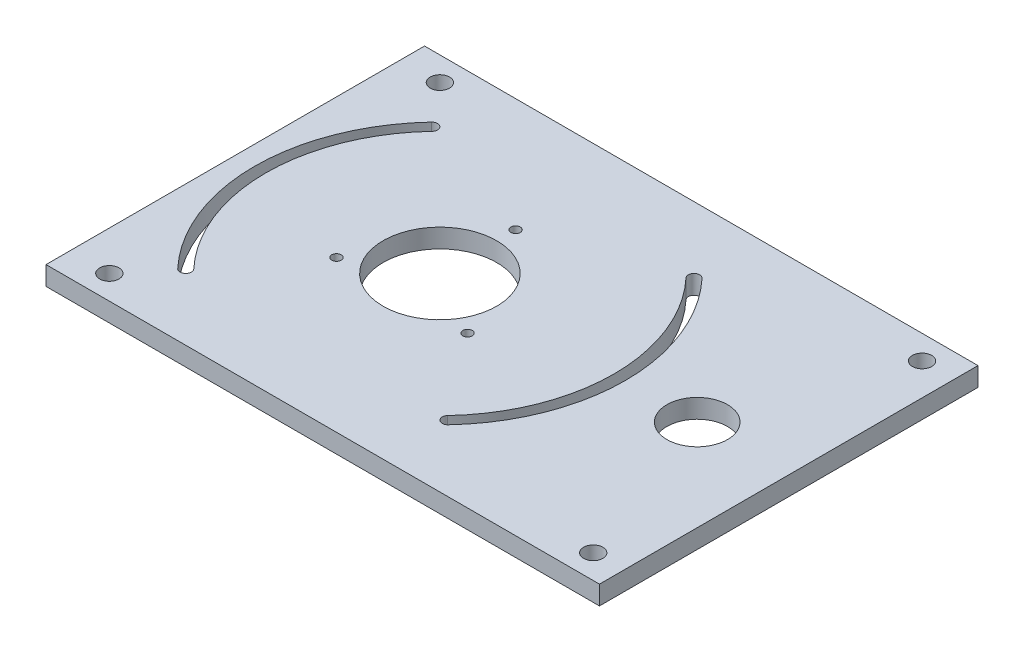
ISO-10303-21;
HEADER;
FILE_DESCRIPTION(('STEP AP214'),'2;1');
FILE_NAME('part.step','',(''),(''),'','','');
FILE_SCHEMA(('AUTOMOTIVE_DESIGN { 1 0 10303 214 1 1 1 1 }'));
ENDSEC;
DATA;
#1=APPLICATION_CONTEXT('core data for automotive mechanical design processes');
#2=APPLICATION_PROTOCOL_DEFINITION('international standard','automotive_design',2000,#1);
#3=PRODUCT_CONTEXT('',#1,'mechanical');
#4=PRODUCT('Part','Part','',(#3));
#5=PRODUCT_RELATED_PRODUCT_CATEGORY('part','',(#4));
#6=PRODUCT_DEFINITION_FORMATION('','',#4);
#7=PRODUCT_DEFINITION_CONTEXT('part definition',#1,'design');
#8=PRODUCT_DEFINITION('design','',#6,#7);
#9=PRODUCT_DEFINITION_SHAPE('','',#8);
#10=(LENGTH_UNIT() NAMED_UNIT(*) SI_UNIT(.MILLI.,.METRE.));
#11=(NAMED_UNIT(*) PLANE_ANGLE_UNIT() SI_UNIT($,.RADIAN.));
#12=(NAMED_UNIT(*) SI_UNIT($,.STERADIAN.) SOLID_ANGLE_UNIT());
#13=UNCERTAINTY_MEASURE_WITH_UNIT(LENGTH_MEASURE(1.E-05),#10,'distance_accuracy_value','');
#14=(GEOMETRIC_REPRESENTATION_CONTEXT(3) GLOBAL_UNCERTAINTY_ASSIGNED_CONTEXT((#13)) GLOBAL_UNIT_ASSIGNED_CONTEXT((#10,
#11,#12)) REPRESENTATION_CONTEXT('',''));
#15=CARTESIAN_POINT('',(0.,0.,0.));
#16=DIRECTION('',(0.,0.,1.));
#17=DIRECTION('',(1.,0.,0.));
#18=AXIS2_PLACEMENT_3D('',#15,#16,#17);
#19=CARTESIAN_POINT('',(-25.5137068979631,-11.,0.));
#20=DIRECTION('',(1.,0.,0.));
#21=DIRECTION('',(0.,0.,-1.));
#22=AXIS2_PLACEMENT_3D('',#19,#20,#21);
#23=PLANE('',#22);
#24=DIRECTION('',(0.,0.,-1.));
#25=VECTOR('',#24,1.);
#26=CARTESIAN_POINT('',(-25.5137068979631,0.,0.));
#27=LINE('',#26,#25);
#28=CARTESIAN_POINT('',(-25.5137068979631,0.,-10.8066674773634));
#29=VERTEX_POINT('',#28);
#30=CARTESIAN_POINT('',(-25.5137068979631,0.,-13.2994483486563));
#31=VERTEX_POINT('',#30);
#32=EDGE_CURVE('E113',#29,#31,#27,.T.);
#33=ORIENTED_EDGE('',*,*,#32,.F.);
#34=DIRECTION('',(0.,1.,0.));
#35=VECTOR('',#34,1.);
#36=CARTESIAN_POINT('',(-25.5137068979631,-11.,-10.8066674773634));
#37=LINE('',#36,#35);
#38=CARTESIAN_POINT('',(-25.5137068979631,-11.,-10.8066674773634));
#39=VERTEX_POINT('',#38);
#40=EDGE_CURVE('E12',#39,#29,#37,.T.);
#41=ORIENTED_EDGE('',*,*,#40,.F.);
#42=DIRECTION('',(0.,0.,-1.));
#43=VECTOR('',#42,1.);
#44=CARTESIAN_POINT('',(-25.5137068979631,-11.,0.));
#45=LINE('',#44,#43);
#46=CARTESIAN_POINT('',(-25.5137068979631,-11.,-13.2994483486563));
#47=VERTEX_POINT('',#46);
#48=EDGE_CURVE('E107',#39,#47,#45,.T.);
#49=ORIENTED_EDGE('',*,*,#48,.T.);
#50=DIRECTION('',(0.,1.,0.));
#51=VECTOR('',#50,1.);
#52=CARTESIAN_POINT('',(-25.5137068979631,-11.,-13.2994483486563));
#53=LINE('',#52,#51);
#54=EDGE_CURVE('E51',#47,#31,#53,.T.);
#55=ORIENTED_EDGE('',*,*,#54,.T.);
#56=EDGE_LOOP('',(#33,#41,#49,#55));
#57=FACE_BOUND('',#56,.T.);
#58=ADVANCED_FACE('F48',(#57),#23,.T.);
#59=CARTESIAN_POINT('',(0.,-11.,20.));
#60=DIRECTION('',(0.,1.,0.));
#61=DIRECTION('',(0.,0.,1.));
#62=AXIS2_PLACEMENT_3D('',#59,#60,#61);
#63=CYLINDRICAL_SURFACE('',#62,40.0000000092002);
#64=CARTESIAN_POINT('',(0.,0.,20.));
#65=DIRECTION('',(0.,1.,0.));
#66=DIRECTION('',(0.,0.,1.));
#67=AXIS2_PLACEMENT_3D('',#64,#65,#66);
#68=CIRCLE('',#67,40.0000000092002);
#69=CARTESIAN_POINT('',(-25.5137068979631,0.,50.8066674773635));
#70=VERTEX_POINT('',#69);
#71=EDGE_CURVE('E109',#29,#70,#68,.T.);
#72=ORIENTED_EDGE('',*,*,#71,.T.);
#73=DIRECTION('',(0.,1.,0.));
#74=VECTOR('',#73,1.);
#75=CARTESIAN_POINT('',(-25.5137068979631,-11.,50.8066674773635));
#76=LINE('',#75,#74);
#77=CARTESIAN_POINT('',(-25.5137068979631,-11.,50.8066674773635));
#78=VERTEX_POINT('',#77);
#79=EDGE_CURVE('E57',#78,#70,#76,.T.);
#80=ORIENTED_EDGE('',*,*,#79,.F.);
#81=CARTESIAN_POINT('',(0.,-11.,20.));
#82=DIRECTION('',(0.,1.,0.));
#83=DIRECTION('',(0.,0.,1.));
#84=AXIS2_PLACEMENT_3D('',#81,#82,#83);
#85=CIRCLE('',#84,40.0000000092002);
#86=EDGE_CURVE('E104',#39,#78,#85,.T.);
#87=ORIENTED_EDGE('',*,*,#86,.F.);
#88=ORIENTED_EDGE('',*,*,#40,.T.);
#89=EDGE_LOOP('',(#72,#80,#87,#88));
#90=FACE_BOUND('',#89,.T.);
#91=ADVANCED_FACE('F120',(#90),#63,.F.);
#92=CARTESIAN_POINT('',(-25.5137068979631,-11.,0.));
#93=DIRECTION('',(1.,0.,0.));
#94=DIRECTION('',(0.,0.,-1.));
#95=AXIS2_PLACEMENT_3D('',#92,#93,#94);
#96=PLANE('',#95);
#97=DIRECTION('',(0.,0.,-1.));
#98=VECTOR('',#97,1.);
#99=CARTESIAN_POINT('',(-25.5137068979631,0.,0.));
#100=LINE('',#99,#98);
#101=CARTESIAN_POINT('',(-25.5137068979631,0.,53.2994483486564));
#102=VERTEX_POINT('',#101);
#103=EDGE_CURVE('E98',#102,#70,#100,.T.);
#104=ORIENTED_EDGE('',*,*,#103,.F.);
#105=DIRECTION('',(0.,1.,0.));
#106=VECTOR('',#105,1.);
#107=CARTESIAN_POINT('',(-25.5137068979631,-11.,53.2994483486564));
#108=LINE('',#107,#106);
#109=CARTESIAN_POINT('',(-25.5137068979631,-11.,53.2994483486564));
#110=VERTEX_POINT('',#109);
#111=EDGE_CURVE('E93',#110,#102,#108,.T.);
#112=ORIENTED_EDGE('',*,*,#111,.F.);
#113=DIRECTION('',(0.,0.,-1.));
#114=VECTOR('',#113,1.);
#115=CARTESIAN_POINT('',(-25.5137068979631,-11.,0.));
#116=LINE('',#115,#114);
#117=EDGE_CURVE('E96',#110,#78,#116,.T.);
#118=ORIENTED_EDGE('',*,*,#117,.T.);
#119=ORIENTED_EDGE('',*,*,#79,.T.);
#120=EDGE_LOOP('',(#104,#112,#118,#119));
#121=FACE_BOUND('',#120,.T.);
#122=ADVANCED_FACE('F95',(#121),#96,.T.);
#123=CARTESIAN_POINT('',(0.,-11.,20.));
#124=DIRECTION('',(0.,1.,0.));
#125=DIRECTION('',(0.,0.,1.));
#126=AXIS2_PLACEMENT_3D('',#123,#124,#125);
#127=CYLINDRICAL_SURFACE('',#126,41.95);
#128=CARTESIAN_POINT('',(0.,0.,20.));
#129=DIRECTION('',(0.,1.,0.));
#130=DIRECTION('',(0.,0.,1.));
#131=AXIS2_PLACEMENT_3D('',#128,#129,#130);
#132=CIRCLE('',#131,41.95);
#133=EDGE_CURVE('E116',#31,#102,#132,.T.);
#134=ORIENTED_EDGE('',*,*,#133,.F.);
#135=ORIENTED_EDGE('',*,*,#54,.F.);
#136=CARTESIAN_POINT('',(0.,-11.,20.));
#137=DIRECTION('',(0.,1.,0.));
#138=DIRECTION('',(0.,0.,1.));
#139=AXIS2_PLACEMENT_3D('',#136,#137,#138);
#140=CIRCLE('',#139,41.95);
#141=EDGE_CURVE('E103',#47,#110,#140,.T.);
#142=ORIENTED_EDGE('',*,*,#141,.T.);
#143=ORIENTED_EDGE('',*,*,#111,.T.);
#144=EDGE_LOOP('',(#134,#135,#142,#143));
#145=FACE_BOUND('',#144,.T.);
#146=ADVANCED_FACE('F106',(#145),#127,.T.);
#147=CARTESIAN_POINT('',(0.,-11.,0.));
#148=DIRECTION('',(0.,1.,0.));
#149=DIRECTION('',(0.,0.,1.));
#150=AXIS2_PLACEMENT_3D('',#147,#148,#149);
#151=PLANE('',#150);
#152=ORIENTED_EDGE('',*,*,#48,.F.);
#153=ORIENTED_EDGE('',*,*,#86,.T.);
#154=ORIENTED_EDGE('',*,*,#117,.F.);
#155=ORIENTED_EDGE('',*,*,#141,.F.);
#156=EDGE_LOOP('',(#152,#153,#154,#155));
#157=FACE_BOUND('',#156,.T.);
#158=ADVANCED_FACE('F102',(#157),#151,.F.);
#159=CARTESIAN_POINT('',(0.,0.,0.));
#160=DIRECTION('',(0.,1.,0.));
#161=DIRECTION('',(0.,0.,1.));
#162=AXIS2_PLACEMENT_3D('',#159,#160,#161);
#163=PLANE('',#162);
#164=ORIENTED_EDGE('',*,*,#32,.T.);
#165=ORIENTED_EDGE('',*,*,#133,.T.);
#166=ORIENTED_EDGE('',*,*,#103,.T.);
#167=ORIENTED_EDGE('',*,*,#71,.F.);
#168=EDGE_LOOP('',(#164,#165,#166,#167));
#169=FACE_BOUND('',#168,.T.);
#170=ADVANCED_FACE('F122',(#169),#163,.T.);
#171=CLOSED_SHELL('',(#58,#91,#122,#146,#158,#170));
#172=MANIFOLD_SOLID_BREP('B2',#171);
#173=CARTESIAN_POINT('',(25.5137068979631,-11.,0.));
#174=DIRECTION('',(1.,0.,0.));
#175=DIRECTION('',(0.,0.,-1.));
#176=AXIS2_PLACEMENT_3D('',#173,#174,#175);
#177=PLANE('',#176);
#178=DIRECTION('',(0.,0.,-1.));
#179=VECTOR('',#178,1.);
#180=CARTESIAN_POINT('',(25.5137068979631,0.,0.));
#181=LINE('',#180,#179);
#182=CARTESIAN_POINT('',(25.5137068979631,0.,53.2994483486564));
#183=VERTEX_POINT('',#182);
#184=CARTESIAN_POINT('',(25.5137068979631,0.,50.8066674773635));
#185=VERTEX_POINT('',#184);
#186=EDGE_CURVE('E245',#183,#185,#181,.T.);
#187=ORIENTED_EDGE('',*,*,#186,.T.);
#188=DIRECTION('',(0.,1.,0.));
#189=VECTOR('',#188,1.);
#190=CARTESIAN_POINT('',(25.5137068979631,-11.,50.8066674773635));
#191=LINE('',#190,#189);
#192=CARTESIAN_POINT('',(25.5137068979631,-11.,50.8066674773635));
#193=VERTEX_POINT('',#192);
#194=EDGE_CURVE('E46',#193,#185,#191,.T.);
#195=ORIENTED_EDGE('',*,*,#194,.F.);
#196=DIRECTION('',(0.,0.,-1.));
#197=VECTOR('',#196,1.);
#198=CARTESIAN_POINT('',(25.5137068979631,-11.,0.));
#199=LINE('',#198,#197);
#200=CARTESIAN_POINT('',(25.5137068979631,-11.,53.2994483486564));
#201=VERTEX_POINT('',#200);
#202=EDGE_CURVE('E240',#201,#193,#199,.T.);
#203=ORIENTED_EDGE('',*,*,#202,.F.);
#204=DIRECTION('',(0.,1.,0.));
#205=VECTOR('',#204,1.);
#206=CARTESIAN_POINT('',(25.5137068979631,-11.,53.2994483486564));
#207=LINE('',#206,#205);
#208=EDGE_CURVE('E184',#201,#183,#207,.T.);
#209=ORIENTED_EDGE('',*,*,#208,.T.);
#210=EDGE_LOOP('',(#187,#195,#203,#209));
#211=FACE_BOUND('',#210,.T.);
#212=ADVANCED_FACE('F181',(#211),#177,.F.);
#213=CARTESIAN_POINT('',(0.,-11.,20.));
#214=DIRECTION('',(0.,1.,0.));
#215=DIRECTION('',(0.,0.,1.));
#216=AXIS2_PLACEMENT_3D('',#213,#214,#215);
#217=CYLINDRICAL_SURFACE('',#216,40.0000000092002);
#218=CARTESIAN_POINT('',(0.,0.,20.));
#219=DIRECTION('',(0.,1.,0.));
#220=DIRECTION('',(0.,0.,1.));
#221=AXIS2_PLACEMENT_3D('',#218,#219,#220);
#222=CIRCLE('',#221,40.0000000092002);
#223=CARTESIAN_POINT('',(25.5137068979631,0.,-10.8066674773634));
#224=VERTEX_POINT('',#223);
#225=EDGE_CURVE('E212',#185,#224,#222,.T.);
#226=ORIENTED_EDGE('',*,*,#225,.T.);
#227=DIRECTION('',(0.,1.,0.));
#228=VECTOR('',#227,1.);
#229=CARTESIAN_POINT('',(25.5137068979631,-11.,-10.8066674773634));
#230=LINE('',#229,#228);
#231=CARTESIAN_POINT('',(25.5137068979631,-11.,-10.8066674773634));
#232=VERTEX_POINT('',#231);
#233=EDGE_CURVE('E190',#232,#224,#230,.T.);
#234=ORIENTED_EDGE('',*,*,#233,.F.);
#235=CARTESIAN_POINT('',(0.,-11.,20.));
#236=DIRECTION('',(0.,1.,0.));
#237=DIRECTION('',(0.,0.,1.));
#238=AXIS2_PLACEMENT_3D('',#235,#236,#237);
#239=CIRCLE('',#238,40.0000000092002);
#240=EDGE_CURVE('E198',#193,#232,#239,.T.);
#241=ORIENTED_EDGE('',*,*,#240,.F.);
#242=ORIENTED_EDGE('',*,*,#194,.T.);
#243=EDGE_LOOP('',(#226,#234,#241,#242));
#244=FACE_BOUND('',#243,.T.);
#245=ADVANCED_FACE('F255',(#244),#217,.F.);
#246=CARTESIAN_POINT('',(25.5137068979631,-11.,0.));
#247=DIRECTION('',(1.,0.,0.));
#248=DIRECTION('',(0.,0.,-1.));
#249=AXIS2_PLACEMENT_3D('',#246,#247,#248);
#250=PLANE('',#249);
#251=DIRECTION('',(0.,0.,-1.));
#252=VECTOR('',#251,1.);
#253=CARTESIAN_POINT('',(25.5137068979631,0.,0.));
#254=LINE('',#253,#252);
#255=CARTESIAN_POINT('',(25.5137068979631,0.,-13.2994483486563));
#256=VERTEX_POINT('',#255);
#257=EDGE_CURVE('E237',#224,#256,#254,.T.);
#258=ORIENTED_EDGE('',*,*,#257,.T.);
#259=DIRECTION('',(0.,1.,0.));
#260=VECTOR('',#259,1.);
#261=CARTESIAN_POINT('',(25.5137068979631,-11.,-13.2994483486563));
#262=LINE('',#261,#260);
#263=CARTESIAN_POINT('',(25.5137068979631,-11.,-13.2994483486563));
#264=VERTEX_POINT('',#263);
#265=EDGE_CURVE('E235',#264,#256,#262,.T.);
#266=ORIENTED_EDGE('',*,*,#265,.F.);
#267=DIRECTION('',(0.,0.,-1.));
#268=VECTOR('',#267,1.);
#269=CARTESIAN_POINT('',(25.5137068979631,-11.,0.));
#270=LINE('',#269,#268);
#271=EDGE_CURVE('E228',#232,#264,#270,.T.);
#272=ORIENTED_EDGE('',*,*,#271,.F.);
#273=ORIENTED_EDGE('',*,*,#233,.T.);
#274=EDGE_LOOP('',(#258,#266,#272,#273));
#275=FACE_BOUND('',#274,.T.);
#276=ADVANCED_FACE('F236',(#275),#250,.F.);
#277=CARTESIAN_POINT('',(0.,-11.,20.));
#278=DIRECTION('',(0.,1.,0.));
#279=DIRECTION('',(0.,0.,1.));
#280=AXIS2_PLACEMENT_3D('',#277,#278,#279);
#281=CYLINDRICAL_SURFACE('',#280,41.95);
#282=CARTESIAN_POINT('',(0.,0.,20.));
#283=DIRECTION('',(0.,1.,0.));
#284=DIRECTION('',(0.,0.,1.));
#285=AXIS2_PLACEMENT_3D('',#282,#283,#284);
#286=CIRCLE('',#285,41.95);
#287=EDGE_CURVE('E248',#183,#256,#286,.T.);
#288=ORIENTED_EDGE('',*,*,#287,.F.);
#289=ORIENTED_EDGE('',*,*,#208,.F.);
#290=CARTESIAN_POINT('',(0.,-11.,20.));
#291=DIRECTION('',(0.,1.,0.));
#292=DIRECTION('',(0.,0.,1.));
#293=AXIS2_PLACEMENT_3D('',#290,#291,#292);
#294=CIRCLE('',#293,41.95);
#295=EDGE_CURVE('E231',#201,#264,#294,.T.);
#296=ORIENTED_EDGE('',*,*,#295,.T.);
#297=ORIENTED_EDGE('',*,*,#265,.T.);
#298=EDGE_LOOP('',(#288,#289,#296,#297));
#299=FACE_BOUND('',#298,.T.);
#300=ADVANCED_FACE('F239',(#299),#281,.T.);
#301=CARTESIAN_POINT('',(0.,-11.,0.));
#302=DIRECTION('',(0.,1.,0.));
#303=DIRECTION('',(0.,0.,1.));
#304=AXIS2_PLACEMENT_3D('',#301,#302,#303);
#305=PLANE('',#304);
#306=ORIENTED_EDGE('',*,*,#202,.T.);
#307=ORIENTED_EDGE('',*,*,#240,.T.);
#308=ORIENTED_EDGE('',*,*,#271,.T.);
#309=ORIENTED_EDGE('',*,*,#295,.F.);
#310=EDGE_LOOP('',(#306,#307,#308,#309));
#311=FACE_BOUND('',#310,.T.);
#312=ADVANCED_FACE('F230',(#311),#305,.F.);
#313=CARTESIAN_POINT('',(0.,0.,0.));
#314=DIRECTION('',(0.,1.,0.));
#315=DIRECTION('',(0.,0.,1.));
#316=AXIS2_PLACEMENT_3D('',#313,#314,#315);
#317=PLANE('',#316);
#318=ORIENTED_EDGE('',*,*,#186,.F.);
#319=ORIENTED_EDGE('',*,*,#287,.T.);
#320=ORIENTED_EDGE('',*,*,#257,.F.);
#321=ORIENTED_EDGE('',*,*,#225,.F.);
#322=EDGE_LOOP('',(#318,#319,#320,#321));
#323=FACE_BOUND('',#322,.T.);
#324=ADVANCED_FACE('F252',(#323),#317,.T.);
#325=CLOSED_SHELL('',(#212,#245,#276,#300,#312,#324));
#326=MANIFOLD_SOLID_BREP('B6',#325);
#327=CARTESIAN_POINT('',(-34.6314808349689,5.,52.5101604914092));
#328=DIRECTION('',(0.,-1.,0.));
#329=DIRECTION('',(0.,0.,-1.));
#330=AXIS2_PLACEMENT_3D('',#327,#328,#329);
#331=CYLINDRICAL_SURFACE('',#330,1.5);
#332=CARTESIAN_POINT('',(-34.6314808349689,0.,52.5101604914092));
#333=DIRECTION('',(0.,1.,0.));
#334=DIRECTION('',(0.,0.,1.));
#335=AXIS2_PLACEMENT_3D('',#332,#333,#334);
#336=CIRCLE('',#335,1.5);
#337=CARTESIAN_POINT('',(-35.7251065455468,0.,53.5367971385064));
#338=VERTEX_POINT('',#337);
#339=CARTESIAN_POINT('',(-33.5378551243909,0.,51.4835238443121));
#340=VERTEX_POINT('',#339);
#341=EDGE_CURVE('E479',#338,#340,#336,.T.);
#342=ORIENTED_EDGE('',*,*,#341,.F.);
#343=DIRECTION('',(0.,-1.,0.));
#344=VECTOR('',#343,1.);
#345=CARTESIAN_POINT('',(-35.7251065455468,5.,53.5367971385064));
#346=LINE('',#345,#344);
#347=CARTESIAN_POINT('',(-35.7251065455468,5.,53.5367971385064));
#348=VERTEX_POINT('',#347);
#349=EDGE_CURVE('E179',#348,#338,#346,.T.);
#350=ORIENTED_EDGE('',*,*,#349,.F.);
#351=CARTESIAN_POINT('',(-34.6314808349689,5.,52.5101604914092));
#352=DIRECTION('',(0.,1.,0.));
#353=DIRECTION('',(0.,0.,1.));
#354=AXIS2_PLACEMENT_3D('',#351,#352,#353);
#355=CIRCLE('',#354,1.5);
#356=CARTESIAN_POINT('',(-33.5378551243909,5.,51.4835238443121));
#357=VERTEX_POINT('',#356);
#358=EDGE_CURVE('E416',#348,#357,#355,.T.);
#359=ORIENTED_EDGE('',*,*,#358,.T.);
#360=DIRECTION('',(0.,-1.,0.));
#361=VECTOR('',#360,1.);
#362=CARTESIAN_POINT('',(-33.5378551243909,5.,51.4835238443121));
#363=LINE('',#362,#361);
#364=EDGE_CURVE('E324',#357,#340,#363,.T.);
#365=ORIENTED_EDGE('',*,*,#364,.T.);
#366=EDGE_LOOP('',(#342,#350,#359,#365));
#367=FACE_BOUND('',#366,.T.);
#368=ADVANCED_FACE('F305',(#367),#331,.F.);
#369=CARTESIAN_POINT('',(0.,5.,20.));
#370=DIRECTION('',(0.,-1.,0.));
#371=DIRECTION('',(0.,0.,-1.));
#372=AXIS2_PLACEMENT_3D('',#369,#370,#371);
#373=CYLINDRICAL_SURFACE('',#372,49.);
#374=CARTESIAN_POINT('',(0.,0.,20.));
#375=DIRECTION('',(0.,1.,0.));
#376=DIRECTION('',(0.,0.,1.));
#377=AXIS2_PLACEMENT_3D('',#374,#375,#376);
#378=CIRCLE('',#377,49.);
#379=CARTESIAN_POINT('',(-35.7251065455468,0.,-13.5367971385063));
#380=VERTEX_POINT('',#379);
#381=EDGE_CURVE('E421',#338,#380,#378,.F.);
#382=ORIENTED_EDGE('',*,*,#381,.T.);
#383=DIRECTION('',(0.,-1.,0.));
#384=VECTOR('',#383,1.);
#385=CARTESIAN_POINT('',(-35.7251065455468,5.,-13.5367971385063));
#386=LINE('',#385,#384);
#387=CARTESIAN_POINT('',(-35.7251065455468,5.,-13.5367971385063));
#388=VERTEX_POINT('',#387);
#389=EDGE_CURVE('E315',#388,#380,#386,.T.);
#390=ORIENTED_EDGE('',*,*,#389,.F.);
#391=CARTESIAN_POINT('',(0.,5.,20.));
#392=DIRECTION('',(0.,1.,0.));
#393=DIRECTION('',(0.,0.,1.));
#394=AXIS2_PLACEMENT_3D('',#391,#392,#393);
#395=CIRCLE('',#394,49.);
#396=EDGE_CURVE('E410',#348,#388,#395,.F.);
#397=ORIENTED_EDGE('',*,*,#396,.F.);
#398=ORIENTED_EDGE('',*,*,#349,.T.);
#399=EDGE_LOOP('',(#382,#390,#397,#398));
#400=FACE_BOUND('',#399,.T.);
#401=ADVANCED_FACE('F419',(#400),#373,.F.);
#402=CARTESIAN_POINT('',(-34.6314808349689,5.,-12.5101604914092));
#403=DIRECTION('',(0.,-1.,0.));
#404=DIRECTION('',(0.,0.,-1.));
#405=AXIS2_PLACEMENT_3D('',#402,#403,#404);
#406=CYLINDRICAL_SURFACE('',#405,1.5);
#407=CARTESIAN_POINT('',(-34.6314808349689,0.,-12.5101604914092));
#408=DIRECTION('',(0.,1.,0.));
#409=DIRECTION('',(0.,0.,1.));
#410=AXIS2_PLACEMENT_3D('',#407,#408,#409);
#411=CIRCLE('',#410,1.5);
#412=CARTESIAN_POINT('',(-33.5378551243909,0.,-11.483523844312));
#413=VERTEX_POINT('',#412);
#414=EDGE_CURVE('E482',#380,#413,#411,.F.);
#415=ORIENTED_EDGE('',*,*,#414,.T.);
#416=DIRECTION('',(0.,-1.,0.));
#417=VECTOR('',#416,1.);
#418=CARTESIAN_POINT('',(-33.5378551243909,5.,-11.483523844312));
#419=LINE('',#418,#417);
#420=CARTESIAN_POINT('',(-33.5378551243909,5.,-11.483523844312));
#421=VERTEX_POINT('',#420);
#422=EDGE_CURVE('E362',#421,#413,#419,.T.);
#423=ORIENTED_EDGE('',*,*,#422,.F.);
#424=CARTESIAN_POINT('',(-34.6314808349689,5.,-12.5101604914092));
#425=DIRECTION('',(0.,1.,0.));
#426=DIRECTION('',(0.,0.,1.));
#427=AXIS2_PLACEMENT_3D('',#424,#425,#426);
#428=CIRCLE('',#427,1.5);
#429=EDGE_CURVE('E402',#388,#421,#428,.F.);
#430=ORIENTED_EDGE('',*,*,#429,.F.);
#431=ORIENTED_EDGE('',*,*,#389,.T.);
#432=EDGE_LOOP('',(#415,#423,#430,#431));
#433=FACE_BOUND('',#432,.T.);
#434=ADVANCED_FACE('F404',(#433),#406,.F.);
#435=CARTESIAN_POINT('',(-9.5814019802184E-13,5.,70.0000000000007));
#436=DIRECTION('',(0.,0.,1.));
#437=DIRECTION('',(1.,0.,0.));
#438=AXIS2_PLACEMENT_3D('',#435,#436,#437);
#439=PLANE('',#438);
#440=DIRECTION('',(-1.,0.,0.));
#441=VECTOR('',#440,1.);
#442=CARTESIAN_POINT('',(-9.5814019802184E-13,0.,70.0000000000007));
#443=LINE('',#442,#441);
#444=CARTESIAN_POINT('',(92.155544892293,0.,70.));
#445=VERTEX_POINT('',#444);
#446=CARTESIAN_POINT('',(-54.055544892293,0.,70.));
#447=VERTEX_POINT('',#446);
#448=EDGE_CURVE('E467',#445,#447,#443,.T.);
#449=ORIENTED_EDGE('',*,*,#448,.F.);
#450=DIRECTION('',(0.,-1.,0.));
#451=VECTOR('',#450,1.);
#452=CARTESIAN_POINT('',(92.155544892293,5.,70.));
#453=LINE('',#452,#451);
#454=CARTESIAN_POINT('',(92.155544892293,5.,70.));
#455=VERTEX_POINT('',#454);
#456=EDGE_CURVE('E433',#455,#445,#453,.T.);
#457=ORIENTED_EDGE('',*,*,#456,.F.);
#458=DIRECTION('',(-1.,0.,0.));
#459=VECTOR('',#458,1.);
#460=CARTESIAN_POINT('',(-9.5814019802184E-13,5.,70.0000000000007));
#461=LINE('',#460,#459);
#462=CARTESIAN_POINT('',(-54.055544892293,5.,70.));
#463=VERTEX_POINT('',#462);
#464=EDGE_CURVE('E515',#455,#463,#461,.T.);
#465=ORIENTED_EDGE('',*,*,#464,.T.);
#466=DIRECTION('',(0.,-1.,0.));
#467=VECTOR('',#466,1.);
#468=CARTESIAN_POINT('',(-54.055544892293,5.,70.));
#469=LINE('',#468,#467);
#470=EDGE_CURVE('E426',#463,#447,#469,.T.);
#471=ORIENTED_EDGE('',*,*,#470,.T.);
#472=EDGE_LOOP('',(#449,#457,#465,#471));
#473=FACE_BOUND('',#472,.T.);
#474=ADVANCED_FACE('F580',(#473),#439,.T.);
#475=CARTESIAN_POINT('',(92.155544892293,5.,0.));
#476=DIRECTION('',(-1.,0.,0.));
#477=DIRECTION('',(0.,0.,1.));
#478=AXIS2_PLACEMENT_3D('',#475,#476,#477);
#479=PLANE('',#478);
#480=DIRECTION('',(0.,0.,-1.));
#481=VECTOR('',#480,1.);
#482=CARTESIAN_POINT('',(92.155544892293,0.,0.));
#483=LINE('',#482,#481);
#484=CARTESIAN_POINT('',(92.155544892293,0.,-30.));
#485=VERTEX_POINT('',#484);
#486=EDGE_CURVE('E470',#445,#485,#483,.T.);
#487=ORIENTED_EDGE('',*,*,#486,.T.);
#488=DIRECTION('',(0.,-1.,0.));
#489=VECTOR('',#488,1.);
#490=CARTESIAN_POINT('',(92.155544892293,5.,-30.));
#491=LINE('',#490,#489);
#492=CARTESIAN_POINT('',(92.155544892293,5.,-30.));
#493=VERTEX_POINT('',#492);
#494=EDGE_CURVE('E430',#493,#485,#491,.T.);
#495=ORIENTED_EDGE('',*,*,#494,.F.);
#496=DIRECTION('',(0.,0.,-1.));
#497=VECTOR('',#496,1.);
#498=CARTESIAN_POINT('',(92.155544892293,5.,0.));
#499=LINE('',#498,#497);
#500=EDGE_CURVE('E518',#455,#493,#499,.T.);
#501=ORIENTED_EDGE('',*,*,#500,.F.);
#502=ORIENTED_EDGE('',*,*,#456,.T.);
#503=EDGE_LOOP('',(#487,#495,#501,#502));
#504=FACE_BOUND('',#503,.T.);
#505=ADVANCED_FACE('F576',(#504),#479,.F.);
#506=CARTESIAN_POINT('',(0.,5.,-30.));
#507=DIRECTION('',(0.,0.,1.));
#508=DIRECTION('',(1.,0.,0.));
#509=AXIS2_PLACEMENT_3D('',#506,#507,#508);
#510=PLANE('',#509);
#511=DIRECTION('',(-1.,0.,0.));
#512=VECTOR('',#511,1.);
#513=CARTESIAN_POINT('',(0.,0.,-30.));
#514=LINE('',#513,#512);
#515=CARTESIAN_POINT('',(-54.055544892293,0.,-30.));
#516=VERTEX_POINT('',#515);
#517=EDGE_CURVE('E473',#485,#516,#514,.T.);
#518=ORIENTED_EDGE('',*,*,#517,.T.);
#519=DIRECTION('',(0.,-1.,0.));
#520=VECTOR('',#519,1.);
#521=CARTESIAN_POINT('',(-54.055544892293,5.,-30.));
#522=LINE('',#521,#520);
#523=CARTESIAN_POINT('',(-54.055544892293,5.,-30.));
#524=VERTEX_POINT('',#523);
#525=EDGE_CURVE('E428',#524,#516,#522,.T.);
#526=ORIENTED_EDGE('',*,*,#525,.F.);
#527=DIRECTION('',(-1.,0.,0.));
#528=VECTOR('',#527,1.);
#529=CARTESIAN_POINT('',(0.,5.,-30.));
#530=LINE('',#529,#528);
#531=EDGE_CURVE('E521',#493,#524,#530,.T.);
#532=ORIENTED_EDGE('',*,*,#531,.F.);
#533=ORIENTED_EDGE('',*,*,#494,.T.);
#534=EDGE_LOOP('',(#518,#526,#532,#533));
#535=FACE_BOUND('',#534,.T.);
#536=ADVANCED_FACE('F573',(#535),#510,.F.);
#537=CARTESIAN_POINT('',(0.,5.,20.));
#538=DIRECTION('',(0.,-1.,0.));
#539=DIRECTION('',(0.,0.,-1.));
#540=AXIS2_PLACEMENT_3D('',#537,#538,#539);
#541=CYLINDRICAL_SURFACE('',#540,46.);
#542=CARTESIAN_POINT('',(0.,0.,20.));
#543=DIRECTION('',(0.,1.,0.));
#544=DIRECTION('',(0.,0.,1.));
#545=AXIS2_PLACEMENT_3D('',#542,#543,#544);
#546=CIRCLE('',#545,46.);
#547=CARTESIAN_POINT('',(33.5378551243909,0.,-11.483523844312));
#548=VERTEX_POINT('',#547);
#549=CARTESIAN_POINT('',(33.5378551243909,0.,51.4835238443121));
#550=VERTEX_POINT('',#549);
#551=EDGE_CURVE('E451',#548,#550,#546,.F.);
#552=ORIENTED_EDGE('',*,*,#551,.F.);
#553=DIRECTION('',(0.,-1.,0.));
#554=VECTOR('',#553,1.);
#555=CARTESIAN_POINT('',(33.5378551243909,5.,-11.483523844312));
#556=LINE('',#555,#554);
#557=CARTESIAN_POINT('',(33.5378551243909,5.,-11.483523844312));
#558=VERTEX_POINT('',#557);
#559=EDGE_CURVE('E374',#558,#548,#556,.T.);
#560=ORIENTED_EDGE('',*,*,#559,.F.);
#561=CARTESIAN_POINT('',(0.,5.,20.));
#562=DIRECTION('',(0.,1.,0.));
#563=DIRECTION('',(0.,0.,1.));
#564=AXIS2_PLACEMENT_3D('',#561,#562,#563);
#565=CIRCLE('',#564,46.);
#566=CARTESIAN_POINT('',(33.5378551243909,5.,51.4835238443121));
#567=VERTEX_POINT('',#566);
#568=EDGE_CURVE('E501',#558,#567,#565,.F.);
#569=ORIENTED_EDGE('',*,*,#568,.T.);
#570=DIRECTION('',(0.,-1.,0.));
#571=VECTOR('',#570,1.);
#572=CARTESIAN_POINT('',(33.5378551243909,5.,51.4835238443121));
#573=LINE('',#572,#571);
#574=EDGE_CURVE('E435',#567,#550,#573,.T.);
#575=ORIENTED_EDGE('',*,*,#574,.T.);
#576=EDGE_LOOP('',(#552,#560,#569,#575));
#577=FACE_BOUND('',#576,.T.);
#578=ADVANCED_FACE('F307',(#577),#541,.T.);
#579=CARTESIAN_POINT('',(34.6314808349689,5.,-12.5101604914092));
#580=DIRECTION('',(0.,-1.,0.));
#581=DIRECTION('',(0.,0.,-1.));
#582=AXIS2_PLACEMENT_3D('',#579,#580,#581);
#583=CYLINDRICAL_SURFACE('',#582,1.5);
#584=CARTESIAN_POINT('',(34.6314808349689,0.,-12.5101604914092));
#585=DIRECTION('',(0.,1.,0.));
#586=DIRECTION('',(0.,0.,1.));
#587=AXIS2_PLACEMENT_3D('',#584,#585,#586);
#588=CIRCLE('',#587,1.5);
#589=CARTESIAN_POINT('',(35.7251065455468,0.,-13.5367971385063));
#590=VERTEX_POINT('',#589);
#591=EDGE_CURVE('E446',#590,#548,#588,.T.);
#592=ORIENTED_EDGE('',*,*,#591,.F.);
#593=DIRECTION('',(0.,-1.,0.));
#594=VECTOR('',#593,1.);
#595=CARTESIAN_POINT('',(35.7251065455468,5.,-13.5367971385063));
#596=LINE('',#595,#594);
#597=CARTESIAN_POINT('',(35.7251065455468,5.,-13.5367971385063));
#598=VERTEX_POINT('',#597);
#599=EDGE_CURVE('E440',#598,#590,#596,.T.);
#600=ORIENTED_EDGE('',*,*,#599,.F.);
#601=CARTESIAN_POINT('',(34.6314808349689,5.,-12.5101604914092));
#602=DIRECTION('',(0.,1.,0.));
#603=DIRECTION('',(0.,0.,1.));
#604=AXIS2_PLACEMENT_3D('',#601,#602,#603);
#605=CIRCLE('',#604,1.5);
#606=EDGE_CURVE('E449',#598,#558,#605,.T.);
#607=ORIENTED_EDGE('',*,*,#606,.T.);
#608=ORIENTED_EDGE('',*,*,#559,.T.);
#609=EDGE_LOOP('',(#592,#600,#607,#608));
#610=FACE_BOUND('',#609,.T.);
#611=ADVANCED_FACE('F444',(#610),#583,.F.);
#612=CARTESIAN_POINT('',(0.,5.,20.));
#613=DIRECTION('',(0.,-1.,0.));
#614=DIRECTION('',(0.,0.,-1.));
#615=AXIS2_PLACEMENT_3D('',#612,#613,#614);
#616=CYLINDRICAL_SURFACE('',#615,49.);
#617=CARTESIAN_POINT('',(0.,0.,20.));
#618=DIRECTION('',(0.,1.,0.));
#619=DIRECTION('',(0.,0.,1.));
#620=AXIS2_PLACEMENT_3D('',#617,#618,#619);
#621=CIRCLE('',#620,49.);
#622=CARTESIAN_POINT('',(35.7251065455468,0.,53.5367971385064));
#623=VERTEX_POINT('',#622);
#624=EDGE_CURVE('E460',#623,#590,#621,.T.);
#625=ORIENTED_EDGE('',*,*,#624,.F.);
#626=DIRECTION('',(0.,-1.,0.));
#627=VECTOR('',#626,1.);
#628=CARTESIAN_POINT('',(35.7251065455468,5.,53.5367971385064));
#629=LINE('',#628,#627);
#630=CARTESIAN_POINT('',(35.7251065455468,5.,53.5367971385064));
#631=VERTEX_POINT('',#630);
#632=EDGE_CURVE('E437',#631,#623,#629,.T.);
#633=ORIENTED_EDGE('',*,*,#632,.F.);
#634=CARTESIAN_POINT('',(0.,5.,20.));
#635=DIRECTION('',(0.,1.,0.));
#636=DIRECTION('',(0.,0.,1.));
#637=AXIS2_PLACEMENT_3D('',#634,#635,#636);
#638=CIRCLE('',#637,49.);
#639=EDGE_CURVE('E505',#631,#598,#638,.T.);
#640=ORIENTED_EDGE('',*,*,#639,.T.);
#641=ORIENTED_EDGE('',*,*,#599,.T.);
#642=EDGE_LOOP('',(#625,#633,#640,#641));
#643=FACE_BOUND('',#642,.T.);
#644=ADVANCED_FACE('F588',(#643),#616,.F.);
#645=CARTESIAN_POINT('',(-17.3127583340425,5.,30.0168995542529));
#646=DIRECTION('',(0.,-1.,0.));
#647=DIRECTION('',(0.,0.,-1.));
#648=AXIS2_PLACEMENT_3D('',#645,#646,#647);
#649=CYLINDRICAL_SURFACE('',#648,1.24999999999998);
#650=CARTESIAN_POINT('',(-17.3127583340425,5.,30.0168995542529));
#651=DIRECTION('',(0.,1.,0.));
#652=DIRECTION('',(0.,0.,1.));
#653=AXIS2_PLACEMENT_3D('',#650,#651,#652);
#654=CIRCLE('',#653,1.24999999999998);
#655=CARTESIAN_POINT('',(-17.3127583340425,5.,31.2668995542529));
#656=VERTEX_POINT('',#655);
#657=EDGE_CURVE('E537',#656,#656,#654,.T.);
#658=ORIENTED_EDGE('',*,*,#657,.T.);
#659=EDGE_LOOP('',(#658));
#660=FACE_BOUND('',#659,.T.);
#661=CARTESIAN_POINT('',(-17.3127583340425,0.,30.0168995542529));
#662=DIRECTION('',(0.,1.,0.));
#663=DIRECTION('',(0.,0.,1.));
#664=AXIS2_PLACEMENT_3D('',#661,#662,#663);
#665=CIRCLE('',#664,1.24999999999998);
#666=CARTESIAN_POINT('',(-17.3127583340425,0.,31.2668995542529));
#667=VERTEX_POINT('',#666);
#668=EDGE_CURVE('E496',#667,#667,#665,.T.);
#669=ORIENTED_EDGE('',*,*,#668,.F.);
#670=EDGE_LOOP('',(#669));
#671=FACE_BOUND('',#670,.T.);
#672=ADVANCED_FACE('F590',(#660,#671),#649,.F.);
#673=CARTESIAN_POINT('',(17.3192487362505,5.,30.0090972111395));
#674=DIRECTION('',(0.,-1.,0.));
#675=DIRECTION('',(0.,0.,-1.));
#676=AXIS2_PLACEMENT_3D('',#673,#674,#675);
#677=CYLINDRICAL_SURFACE('',#676,1.24999999999998);
#678=CARTESIAN_POINT('',(17.3192487362505,5.,30.0090972111395));
#679=DIRECTION('',(0.,1.,0.));
#680=DIRECTION('',(0.,0.,1.));
#681=AXIS2_PLACEMENT_3D('',#678,#679,#680);
#682=CIRCLE('',#681,1.24999999999998);
#683=CARTESIAN_POINT('',(17.3192487362505,5.,31.2590972111395));
#684=VERTEX_POINT('',#683);
#685=EDGE_CURVE('E534',#684,#684,#682,.T.);
#686=ORIENTED_EDGE('',*,*,#685,.T.);
#687=EDGE_LOOP('',(#686));
#688=FACE_BOUND('',#687,.T.);
#689=CARTESIAN_POINT('',(17.3192487362505,0.,30.0090972111395));
#690=DIRECTION('',(0.,1.,0.));
#691=DIRECTION('',(0.,0.,1.));
#692=AXIS2_PLACEMENT_3D('',#689,#690,#691);
#693=CIRCLE('',#692,1.24999999999998);
#694=CARTESIAN_POINT('',(17.3192487362505,0.,31.2590972111395));
#695=VERTEX_POINT('',#694);
#696=EDGE_CURVE('E493',#695,#695,#693,.T.);
#697=ORIENTED_EDGE('',*,*,#696,.F.);
#698=EDGE_LOOP('',(#697));
#699=FACE_BOUND('',#698,.T.);
#700=ADVANCED_FACE('F679',(#688,#699),#677,.F.);
#701=CARTESIAN_POINT('',(0.000990516123400287,5.,0.00520135897268126));
#702=DIRECTION('',(0.,-1.,0.));
#703=DIRECTION('',(0.,0.,-1.));
#704=AXIS2_PLACEMENT_3D('',#701,#702,#703);
#705=CYLINDRICAL_SURFACE('',#704,1.24999999999998);
#706=CARTESIAN_POINT('',(0.000990516123400287,5.,0.00520135897268126));
#707=DIRECTION('',(0.,1.,0.));
#708=DIRECTION('',(0.,0.,1.));
#709=AXIS2_PLACEMENT_3D('',#706,#707,#708);
#710=CIRCLE('',#709,1.24999999999998);
#711=CARTESIAN_POINT('',(0.000990516123400287,5.,1.25520135897266));
#712=VERTEX_POINT('',#711);
#713=EDGE_CURVE('E531',#712,#712,#710,.T.);
#714=ORIENTED_EDGE('',*,*,#713,.T.);
#715=EDGE_LOOP('',(#714));
#716=FACE_BOUND('',#715,.T.);
#717=CARTESIAN_POINT('',(0.000990516123400287,0.,0.00520135897268126));
#718=DIRECTION('',(0.,1.,0.));
#719=DIRECTION('',(0.,0.,1.));
#720=AXIS2_PLACEMENT_3D('',#717,#718,#719);
#721=CIRCLE('',#720,1.24999999999998);
#722=CARTESIAN_POINT('',(0.000990516123400287,0.,1.25520135897266));
#723=VERTEX_POINT('',#722);
#724=EDGE_CURVE('E490',#723,#723,#721,.T.);
#725=ORIENTED_EDGE('',*,*,#724,.F.);
#726=EDGE_LOOP('',(#725));
#727=FACE_BOUND('',#726,.T.);
#728=ADVANCED_FACE('F688',(#716,#727),#705,.F.);
#729=CARTESIAN_POINT('',(67.9999970572037,5.,20.0200055064452));
#730=DIRECTION('',(0.,-1.,0.));
#731=DIRECTION('',(0.,0.,-1.));
#732=AXIS2_PLACEMENT_3D('',#729,#730,#731);
#733=CYLINDRICAL_SURFACE('',#732,8.00000000000001);
#734=CARTESIAN_POINT('',(67.9999970572037,5.,20.0200055064452));
#735=DIRECTION('',(0.,1.,0.));
#736=DIRECTION('',(0.,0.,1.));
#737=AXIS2_PLACEMENT_3D('',#734,#735,#736);
#738=CIRCLE('',#737,8.00000000000001);
#739=CARTESIAN_POINT('',(67.9999970572037,5.,28.0200055064453));
#740=VERTEX_POINT('',#739);
#741=EDGE_CURVE('E528',#740,#740,#738,.T.);
#742=ORIENTED_EDGE('',*,*,#741,.T.);
#743=EDGE_LOOP('',(#742));
#744=FACE_BOUND('',#743,.T.);
#745=CARTESIAN_POINT('',(67.9999970572037,0.,20.0200055064452));
#746=DIRECTION('',(0.,1.,0.));
#747=DIRECTION('',(0.,0.,1.));
#748=AXIS2_PLACEMENT_3D('',#745,#746,#747);
#749=CIRCLE('',#748,8.00000000000001);
#750=CARTESIAN_POINT('',(67.9999970572037,0.,28.0200055064453));
#751=VERTEX_POINT('',#750);
#752=EDGE_CURVE('E487',#751,#751,#749,.T.);
#753=ORIENTED_EDGE('',*,*,#752,.F.);
#754=EDGE_LOOP('',(#753));
#755=FACE_BOUND('',#754,.T.);
#756=ADVANCED_FACE('F697',(#744,#755),#733,.F.);
#757=CARTESIAN_POINT('',(0.,5.,20.));
#758=DIRECTION('',(0.,-1.,0.));
#759=DIRECTION('',(0.,0.,-1.));
#760=AXIS2_PLACEMENT_3D('',#757,#758,#759);
#761=CYLINDRICAL_SURFACE('',#760,46.);
#762=CARTESIAN_POINT('',(0.,0.,20.));
#763=DIRECTION('',(0.,1.,0.));
#764=DIRECTION('',(0.,0.,1.));
#765=AXIS2_PLACEMENT_3D('',#762,#763,#764);
#766=CIRCLE('',#765,46.);
#767=EDGE_CURVE('E484',#340,#413,#766,.F.);
#768=ORIENTED_EDGE('',*,*,#767,.F.);
#769=ORIENTED_EDGE('',*,*,#364,.F.);
#770=CARTESIAN_POINT('',(0.,5.,20.));
#771=DIRECTION('',(0.,1.,0.));
#772=DIRECTION('',(0.,0.,1.));
#773=AXIS2_PLACEMENT_3D('',#770,#771,#772);
#774=CIRCLE('',#773,46.);
#775=EDGE_CURVE('E409',#357,#421,#774,.F.);
#776=ORIENTED_EDGE('',*,*,#775,.T.);
#777=ORIENTED_EDGE('',*,*,#422,.T.);
#778=EDGE_LOOP('',(#768,#769,#776,#777));
#779=FACE_BOUND('',#778,.T.);
#780=ADVANCED_FACE('F571',(#779),#761,.T.);
#781=CARTESIAN_POINT('',(-54.055544892293,5.,0.));
#782=DIRECTION('',(-1.,0.,0.));
#783=DIRECTION('',(0.,0.,1.));
#784=AXIS2_PLACEMENT_3D('',#781,#782,#783);
#785=PLANE('',#784);
#786=DIRECTION('',(0.,0.,-1.));
#787=VECTOR('',#786,1.);
#788=CARTESIAN_POINT('',(-54.055544892293,0.,0.));
#789=LINE('',#788,#787);
#790=EDGE_CURVE('E476',#447,#516,#789,.T.);
#791=ORIENTED_EDGE('',*,*,#790,.F.);
#792=ORIENTED_EDGE('',*,*,#470,.F.);
#793=DIRECTION('',(0.,0.,-1.));
#794=VECTOR('',#793,1.);
#795=CARTESIAN_POINT('',(-54.055544892293,5.,0.));
#796=LINE('',#795,#794);
#797=EDGE_CURVE('E523',#463,#524,#796,.T.);
#798=ORIENTED_EDGE('',*,*,#797,.T.);
#799=ORIENTED_EDGE('',*,*,#525,.T.);
#800=EDGE_LOOP('',(#791,#792,#798,#799));
#801=FACE_BOUND('',#800,.T.);
#802=ADVANCED_FACE('F568',(#801),#785,.T.);
#803=CARTESIAN_POINT('',(34.6314808349689,5.,52.5101604914092));
#804=DIRECTION('',(0.,-1.,0.));
#805=DIRECTION('',(0.,0.,-1.));
#806=AXIS2_PLACEMENT_3D('',#803,#804,#805);
#807=CYLINDRICAL_SURFACE('',#806,1.5);
#808=CARTESIAN_POINT('',(34.6314808349689,0.,52.5101604914092));
#809=DIRECTION('',(0.,1.,0.));
#810=DIRECTION('',(0.,0.,1.));
#811=AXIS2_PLACEMENT_3D('',#808,#809,#810);
#812=CIRCLE('',#811,1.5);
#813=EDGE_CURVE('E462',#623,#550,#812,.F.);
#814=ORIENTED_EDGE('',*,*,#813,.T.);
#815=ORIENTED_EDGE('',*,*,#574,.F.);
#816=CARTESIAN_POINT('',(34.6314808349689,5.,52.5101604914092));
#817=DIRECTION('',(0.,1.,0.));
#818=DIRECTION('',(0.,0.,1.));
#819=AXIS2_PLACEMENT_3D('',#816,#817,#818);
#820=CIRCLE('',#819,1.5);
#821=EDGE_CURVE('E513',#631,#567,#820,.F.);
#822=ORIENTED_EDGE('',*,*,#821,.F.);
#823=ORIENTED_EDGE('',*,*,#632,.T.);
#824=EDGE_LOOP('',(#814,#815,#822,#823));
#825=FACE_BOUND('',#824,.T.);
#826=ADVANCED_FACE('F555',(#825),#807,.F.);
#827=CARTESIAN_POINT('',(0.,5.,20.));
#828=DIRECTION('',(0.,-1.,0.));
#829=DIRECTION('',(0.,0.,-1.));
#830=AXIS2_PLACEMENT_3D('',#827,#828,#829);
#831=CYLINDRICAL_SURFACE('',#830,15.);
#832=CARTESIAN_POINT('',(0.,5.,20.));
#833=DIRECTION('',(0.,1.,0.));
#834=DIRECTION('',(0.,0.,1.));
#835=AXIS2_PLACEMENT_3D('',#832,#833,#834);
#836=CIRCLE('',#835,15.);
#837=CARTESIAN_POINT('',(0.,5.,35.0000000000001));
#838=VERTEX_POINT('',#837);
#839=EDGE_CURVE('E438',#838,#838,#836,.T.);
#840=ORIENTED_EDGE('',*,*,#839,.T.);
#841=EDGE_LOOP('',(#840));
#842=FACE_BOUND('',#841,.T.);
#843=CARTESIAN_POINT('',(0.,0.,20.));
#844=DIRECTION('',(0.,1.,0.));
#845=DIRECTION('',(0.,0.,1.));
#846=AXIS2_PLACEMENT_3D('',#843,#844,#845);
#847=CIRCLE('',#846,15.);
#848=CARTESIAN_POINT('',(0.,0.,35.0000000000001));
#849=VERTEX_POINT('',#848);
#850=EDGE_CURVE('E499',#849,#849,#847,.T.);
#851=ORIENTED_EDGE('',*,*,#850,.F.);
#852=EDGE_LOOP('',(#851));
#853=FACE_BOUND('',#852,.T.);
#854=ADVANCED_FACE('F542',(#842,#853),#831,.F.);
#855=CARTESIAN_POINT('',(0.,5.,0.));
#856=DIRECTION('',(0.,1.,0.));
#857=DIRECTION('',(0.,0.,1.));
#858=AXIS2_PLACEMENT_3D('',#855,#856,#857);
#859=PLANE('',#858);
#860=CARTESIAN_POINT('',(-43.6629042578193,5.,63.6629042578203));
#861=DIRECTION('',(0.,1.,0.));
#862=DIRECTION('',(0.,0.,1.));
#863=AXIS2_PLACEMENT_3D('',#860,#861,#862);
#864=CIRCLE('',#863,2.55269999999999);
#865=CARTESIAN_POINT('',(-43.6629042578193,5.,66.2156042578203));
#866=VERTEX_POINT('',#865);
#867=EDGE_CURVE('E879',#866,#866,#864,.T.);
#868=ORIENTED_EDGE('',*,*,#867,.F.);
#869=EDGE_LOOP('',(#868));
#870=FACE_BOUND('',#869,.T.);
#871=CARTESIAN_POINT('',(-43.6629042578201,5.,-23.6629042578194));
#872=DIRECTION('',(0.,1.,0.));
#873=DIRECTION('',(0.,0.,1.));
#874=AXIS2_PLACEMENT_3D('',#871,#872,#873);
#875=CIRCLE('',#874,2.55269999999999);
#876=CARTESIAN_POINT('',(-43.6629042578201,5.,-21.1102042578194));
#877=VERTEX_POINT('',#876);
#878=EDGE_CURVE('E889',#877,#877,#875,.T.);
#879=ORIENTED_EDGE('',*,*,#878,.F.);
#880=EDGE_LOOP('',(#879));
#881=FACE_BOUND('',#880,.T.);
#882=CARTESIAN_POINT('',(83.7109397886486,5.,-23.6629042578194));
#883=DIRECTION('',(0.,1.,0.));
#884=DIRECTION('',(0.,0.,1.));
#885=AXIS2_PLACEMENT_3D('',#882,#883,#884);
#886=CIRCLE('',#885,2.55269999999999);
#887=CARTESIAN_POINT('',(83.7109397886486,5.,-21.1102042578194));
#888=VERTEX_POINT('',#887);
#889=EDGE_CURVE('E894',#888,#888,#886,.T.);
#890=ORIENTED_EDGE('',*,*,#889,.F.);
#891=EDGE_LOOP('',(#890));
#892=FACE_BOUND('',#891,.T.);
#893=CARTESIAN_POINT('',(84.1709362179266,5.,63.6629042578203));
#894=DIRECTION('',(0.,1.,0.));
#895=DIRECTION('',(0.,0.,1.));
#896=AXIS2_PLACEMENT_3D('',#893,#894,#895);
#897=CIRCLE('',#896,2.55269999999999);
#898=CARTESIAN_POINT('',(84.1709362179266,5.,66.2156042578203));
#899=VERTEX_POINT('',#898);
#900=EDGE_CURVE('E309',#899,#899,#897,.T.);
#901=ORIENTED_EDGE('',*,*,#900,.F.);
#902=EDGE_LOOP('',(#901));
#903=FACE_BOUND('',#902,.T.);
#904=ORIENTED_EDGE('',*,*,#568,.F.);
#905=ORIENTED_EDGE('',*,*,#606,.F.);
#906=ORIENTED_EDGE('',*,*,#639,.F.);
#907=ORIENTED_EDGE('',*,*,#821,.T.);
#908=EDGE_LOOP('',(#904,#905,#906,#907));
#909=FACE_BOUND('',#908,.T.);
#910=ORIENTED_EDGE('',*,*,#464,.F.);
#911=ORIENTED_EDGE('',*,*,#500,.T.);
#912=ORIENTED_EDGE('',*,*,#531,.T.);
#913=ORIENTED_EDGE('',*,*,#797,.F.);
#914=EDGE_LOOP('',(#910,#911,#912,#913));
#915=FACE_BOUND('',#914,.T.);
#916=ORIENTED_EDGE('',*,*,#358,.F.);
#917=ORIENTED_EDGE('',*,*,#396,.T.);
#918=ORIENTED_EDGE('',*,*,#429,.T.);
#919=ORIENTED_EDGE('',*,*,#775,.F.);
#920=EDGE_LOOP('',(#916,#917,#918,#919));
#921=FACE_BOUND('',#920,.T.);
#922=ORIENTED_EDGE('',*,*,#741,.F.);
#923=EDGE_LOOP('',(#922));
#924=FACE_BOUND('',#923,.T.);
#925=ORIENTED_EDGE('',*,*,#713,.F.);
#926=EDGE_LOOP('',(#925));
#927=FACE_BOUND('',#926,.T.);
#928=ORIENTED_EDGE('',*,*,#685,.F.);
#929=EDGE_LOOP('',(#928));
#930=FACE_BOUND('',#929,.T.);
#931=ORIENTED_EDGE('',*,*,#657,.F.);
#932=EDGE_LOOP('',(#931));
#933=FACE_BOUND('',#932,.T.);
#934=ORIENTED_EDGE('',*,*,#839,.F.);
#935=EDGE_LOOP('',(#934));
#936=FACE_BOUND('',#935,.T.);
#937=ADVANCED_FACE('F414',(#870,#881,#892,#903,#909,#915,#921,#924,#927,#930,#933,#936),#859,.T.);
#938=CARTESIAN_POINT('',(0.,0.,0.));
#939=DIRECTION('',(0.,1.,0.));
#940=DIRECTION('',(0.,0.,1.));
#941=AXIS2_PLACEMENT_3D('',#938,#939,#940);
#942=PLANE('',#941);
#943=CARTESIAN_POINT('',(-43.6629042578193,0.,63.6629042578203));
#944=DIRECTION('',(0.,-1.,0.));
#945=DIRECTION('',(0.,0.,-1.));
#946=AXIS2_PLACEMENT_3D('',#943,#944,#945);
#947=CIRCLE('',#946,2.55269999999999);
#948=CARTESIAN_POINT('',(-43.6629042578193,0.,61.1102042578203));
#949=VERTEX_POINT('',#948);
#950=EDGE_CURVE('E882',#949,#949,#947,.T.);
#951=ORIENTED_EDGE('',*,*,#950,.F.);
#952=EDGE_LOOP('',(#951));
#953=FACE_BOUND('',#952,.T.);
#954=CARTESIAN_POINT('',(-43.6629042578201,0.,-23.6629042578194));
#955=DIRECTION('',(0.,-1.,0.));
#956=DIRECTION('',(0.,0.,-1.));
#957=AXIS2_PLACEMENT_3D('',#954,#955,#956);
#958=CIRCLE('',#957,2.55269999999999);
#959=CARTESIAN_POINT('',(-43.6629042578201,0.,-26.2156042578194));
#960=VERTEX_POINT('',#959);
#961=EDGE_CURVE('E884',#960,#960,#958,.T.);
#962=ORIENTED_EDGE('',*,*,#961,.F.);
#963=EDGE_LOOP('',(#962));
#964=FACE_BOUND('',#963,.T.);
#965=CARTESIAN_POINT('',(83.7109397886486,0.,-23.6629042578194));
#966=DIRECTION('',(0.,-1.,0.));
#967=DIRECTION('',(0.,0.,-1.));
#968=AXIS2_PLACEMENT_3D('',#965,#966,#967);
#969=CIRCLE('',#968,2.55269999999999);
#970=CARTESIAN_POINT('',(83.7109397886486,0.,-26.2156042578194));
#971=VERTEX_POINT('',#970);
#972=EDGE_CURVE('E892',#971,#971,#969,.T.);
#973=ORIENTED_EDGE('',*,*,#972,.F.);
#974=EDGE_LOOP('',(#973));
#975=FACE_BOUND('',#974,.T.);
#976=CARTESIAN_POINT('',(84.1709362179266,0.,63.6629042578203));
#977=DIRECTION('',(0.,-1.,0.));
#978=DIRECTION('',(0.,0.,-1.));
#979=AXIS2_PLACEMENT_3D('',#976,#977,#978);
#980=CIRCLE('',#979,2.55269999999999);
#981=CARTESIAN_POINT('',(84.1709362179266,0.,61.1102042578203));
#982=VERTEX_POINT('',#981);
#983=EDGE_CURVE('E508',#982,#982,#980,.T.);
#984=ORIENTED_EDGE('',*,*,#983,.F.);
#985=EDGE_LOOP('',(#984));
#986=FACE_BOUND('',#985,.T.);
#987=ORIENTED_EDGE('',*,*,#551,.T.);
#988=ORIENTED_EDGE('',*,*,#813,.F.);
#989=ORIENTED_EDGE('',*,*,#624,.T.);
#990=ORIENTED_EDGE('',*,*,#591,.T.);
#991=EDGE_LOOP('',(#987,#988,#989,#990));
#992=FACE_BOUND('',#991,.T.);
#993=ORIENTED_EDGE('',*,*,#448,.T.);
#994=ORIENTED_EDGE('',*,*,#790,.T.);
#995=ORIENTED_EDGE('',*,*,#517,.F.);
#996=ORIENTED_EDGE('',*,*,#486,.F.);
#997=EDGE_LOOP('',(#993,#994,#995,#996));
#998=FACE_BOUND('',#997,.T.);
#999=ORIENTED_EDGE('',*,*,#341,.T.);
#1000=ORIENTED_EDGE('',*,*,#767,.T.);
#1001=ORIENTED_EDGE('',*,*,#414,.F.);
#1002=ORIENTED_EDGE('',*,*,#381,.F.);
#1003=EDGE_LOOP('',(#999,#1000,#1001,#1002));
#1004=FACE_BOUND('',#1003,.T.);
#1005=ORIENTED_EDGE('',*,*,#752,.T.);
#1006=EDGE_LOOP('',(#1005));
#1007=FACE_BOUND('',#1006,.T.);
#1008=ORIENTED_EDGE('',*,*,#724,.T.);
#1009=EDGE_LOOP('',(#1008));
#1010=FACE_BOUND('',#1009,.T.);
#1011=ORIENTED_EDGE('',*,*,#696,.T.);
#1012=EDGE_LOOP('',(#1011));
#1013=FACE_BOUND('',#1012,.T.);
#1014=ORIENTED_EDGE('',*,*,#668,.T.);
#1015=EDGE_LOOP('',(#1014));
#1016=FACE_BOUND('',#1015,.T.);
#1017=ORIENTED_EDGE('',*,*,#850,.T.);
#1018=EDGE_LOOP('',(#1017));
#1019=FACE_BOUND('',#1018,.T.);
#1020=ADVANCED_FACE('F457',(#953,#964,#975,#986,#992,#998,#1004,#1007,#1010,#1013,#1016,#1019),
#942,.F.);
#1021=CARTESIAN_POINT('',(84.1709362179266,0.,63.6629042578203));
#1022=DIRECTION('',(0.,-1.,0.));
#1023=DIRECTION('',(0.,0.,-1.));
#1024=AXIS2_PLACEMENT_3D('',#1021,#1022,#1023);
#1025=CYLINDRICAL_SURFACE('',#1024,2.55269999999999);
#1026=ORIENTED_EDGE('',*,*,#900,.T.);
#1027=EDGE_LOOP('',(#1026));
#1028=FACE_BOUND('',#1027,.T.);
#1029=ORIENTED_EDGE('',*,*,#983,.T.);
#1030=EDGE_LOOP('',(#1029));
#1031=FACE_BOUND('',#1030,.T.);
#1032=ADVANCED_FACE('F552',(#1028,#1031),#1025,.F.);
#1033=CARTESIAN_POINT('',(83.7109397886486,0.,-23.6629042578194));
#1034=DIRECTION('',(0.,-1.,0.));
#1035=DIRECTION('',(0.,0.,-1.));
#1036=AXIS2_PLACEMENT_3D('',#1033,#1034,#1035);
#1037=CYLINDRICAL_SURFACE('',#1036,2.55269999999999);
#1038=ORIENTED_EDGE('',*,*,#889,.T.);
#1039=EDGE_LOOP('',(#1038));
#1040=FACE_BOUND('',#1039,.T.);
#1041=ORIENTED_EDGE('',*,*,#972,.T.);
#1042=EDGE_LOOP('',(#1041));
#1043=FACE_BOUND('',#1042,.T.);
#1044=ADVANCED_FACE('F844',(#1040,#1043),#1037,.F.);
#1045=CARTESIAN_POINT('',(-43.6629042578201,0.,-23.6629042578194));
#1046=DIRECTION('',(0.,-1.,0.));
#1047=DIRECTION('',(0.,0.,-1.));
#1048=AXIS2_PLACEMENT_3D('',#1045,#1046,#1047);
#1049=CYLINDRICAL_SURFACE('',#1048,2.55269999999999);
#1050=ORIENTED_EDGE('',*,*,#878,.T.);
#1051=EDGE_LOOP('',(#1050));
#1052=FACE_BOUND('',#1051,.T.);
#1053=ORIENTED_EDGE('',*,*,#961,.T.);
#1054=EDGE_LOOP('',(#1053));
#1055=FACE_BOUND('',#1054,.T.);
#1056=ADVANCED_FACE('F852',(#1052,#1055),#1049,.F.);
#1057=CARTESIAN_POINT('',(-43.6629042578193,0.,63.6629042578203));
#1058=DIRECTION('',(0.,-1.,0.));
#1059=DIRECTION('',(0.,0.,-1.));
#1060=AXIS2_PLACEMENT_3D('',#1057,#1058,#1059);
#1061=CYLINDRICAL_SURFACE('',#1060,2.55269999999999);
#1062=ORIENTED_EDGE('',*,*,#867,.T.);
#1063=EDGE_LOOP('',(#1062));
#1064=FACE_BOUND('',#1063,.T.);
#1065=ORIENTED_EDGE('',*,*,#950,.T.);
#1066=EDGE_LOOP('',(#1065));
#1067=FACE_BOUND('',#1066,.T.);
#1068=ADVANCED_FACE('F861',(#1064,#1067),#1061,.F.);
#1069=CLOSED_SHELL('',(#368,#401,#434,#474,#505,#536,#578,#611,#644,#672,#700,#728,#756,#780,
#802,#826,#854,#937,#1020,#1032,#1044,#1056,#1068));
#1070=MANIFOLD_SOLID_BREP('B40',#1069);
#1071=ADVANCED_BREP_SHAPE_REPRESENTATION('',(#18,#172,#326,#1070),#14);
#1072=SHAPE_DEFINITION_REPRESENTATION(#9,#1071);
ENDSEC;
END-ISO-10303-21;
